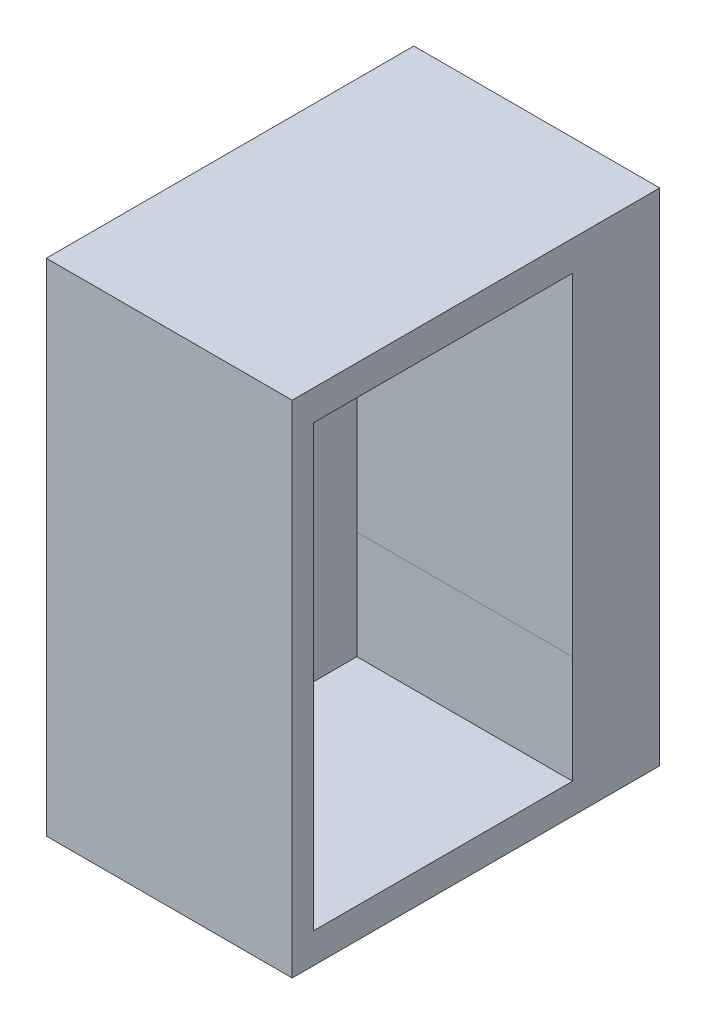
ISO-10303-21;
HEADER;
FILE_DESCRIPTION(('STEP AP214'),'2;1');
FILE_NAME('part.step','',(''),(''),'','','');
FILE_SCHEMA(('AUTOMOTIVE_DESIGN { 1 0 10303 214 1 1 1 1 }'));
ENDSEC;
DATA;
#1=APPLICATION_CONTEXT('core data for automotive mechanical design processes');
#2=APPLICATION_PROTOCOL_DEFINITION('international standard','automotive_design',2000,#1);
#3=PRODUCT_CONTEXT('',#1,'mechanical');
#4=PRODUCT('Part','Part','',(#3));
#5=PRODUCT_RELATED_PRODUCT_CATEGORY('part','',(#4));
#6=PRODUCT_DEFINITION_FORMATION('','',#4);
#7=PRODUCT_DEFINITION_CONTEXT('part definition',#1,'design');
#8=PRODUCT_DEFINITION('design','',#6,#7);
#9=PRODUCT_DEFINITION_SHAPE('','',#8);
#10=(LENGTH_UNIT() NAMED_UNIT(*) SI_UNIT(.MILLI.,.METRE.));
#11=(NAMED_UNIT(*) PLANE_ANGLE_UNIT() SI_UNIT($,.RADIAN.));
#12=(NAMED_UNIT(*) SI_UNIT($,.STERADIAN.) SOLID_ANGLE_UNIT());
#13=UNCERTAINTY_MEASURE_WITH_UNIT(LENGTH_MEASURE(1.E-05),#10,'distance_accuracy_value','');
#14=(GEOMETRIC_REPRESENTATION_CONTEXT(3) GLOBAL_UNCERTAINTY_ASSIGNED_CONTEXT((#13)) GLOBAL_UNIT_ASSIGNED_CONTEXT((#10,
#11,#12)) REPRESENTATION_CONTEXT('',''));
#15=CARTESIAN_POINT('',(0.,0.,0.));
#16=DIRECTION('',(0.,0.,1.));
#17=DIRECTION('',(1.,0.,0.));
#18=AXIS2_PLACEMENT_3D('',#15,#16,#17);
#19=CARTESIAN_POINT('',(-38.,-69.,20.2));
#20=DIRECTION('',(1.,0.,0.));
#21=DIRECTION('',(0.,0.,-1.));
#22=AXIS2_PLACEMENT_3D('',#19,#20,#21);
#23=PLANE('',#22);
#24=DIRECTION('',(0.,-1.,0.));
#25=VECTOR('',#24,1.);
#26=CARTESIAN_POINT('',(-38.,0.,0.));
#27=LINE('',#26,#25);
#28=CARTESIAN_POINT('',(-38.,40.,0.));
#29=VERTEX_POINT('',#28);
#30=CARTESIAN_POINT('',(-38.,-76.,0.));
#31=VERTEX_POINT('',#30);
#32=EDGE_CURVE('E155',#29,#31,#27,.T.);
#33=ORIENTED_EDGE('',*,*,#32,.F.);
#34=DIRECTION('',(0.,0.,-1.));
#35=VECTOR('',#34,1.);
#36=CARTESIAN_POINT('',(-38.,40.,80.2));
#37=LINE('',#36,#35);
#38=CARTESIAN_POINT('',(-38.,40.,85.2));
#39=VERTEX_POINT('',#38);
#40=EDGE_CURVE('E51',#39,#29,#37,.T.);
#41=ORIENTED_EDGE('',*,*,#40,.F.);
#42=DIRECTION('',(0.,1.,0.));
#43=VECTOR('',#42,1.);
#44=CARTESIAN_POINT('',(-38.,-76.,85.2));
#45=LINE('',#44,#43);
#46=CARTESIAN_POINT('',(-38.,-76.,85.2));
#47=VERTEX_POINT('',#46);
#48=EDGE_CURVE('E43',#47,#39,#45,.T.);
#49=ORIENTED_EDGE('',*,*,#48,.F.);
#50=DIRECTION('',(0.,0.,-1.));
#51=VECTOR('',#50,1.);
#52=CARTESIAN_POINT('',(-38.,-76.,26.0999));
#53=LINE('',#52,#51);
#54=CARTESIAN_POINT('',(-38.,-76.,20.2));
#55=VERTEX_POINT('',#54);
#56=EDGE_CURVE('E231',#47,#55,#53,.T.);
#57=ORIENTED_EDGE('',*,*,#56,.T.);
#58=DIRECTION('',(0.,1.,0.));
#59=VECTOR('',#58,1.);
#60=CARTESIAN_POINT('',(-38.,0.,20.2));
#61=LINE('',#60,#59);
#62=CARTESIAN_POINT('',(-38.,-69.,20.2));
#63=VERTEX_POINT('',#62);
#64=EDGE_CURVE('E203',#55,#63,#61,.T.);
#65=ORIENTED_EDGE('',*,*,#64,.T.);
#66=DIRECTION('',(0.,0.,-1.));
#67=VECTOR('',#66,1.);
#68=CARTESIAN_POINT('',(-38.,-69.,80.2));
#69=LINE('',#68,#67);
#70=CARTESIAN_POINT('',(-38.,-69.,80.2));
#71=VERTEX_POINT('',#70);
#72=EDGE_CURVE('E185',#71,#63,#69,.T.);
#73=ORIENTED_EDGE('',*,*,#72,.F.);
#74=DIRECTION('',(0.,1.,0.));
#75=VECTOR('',#74,1.);
#76=CARTESIAN_POINT('',(-38.,-76.,80.2));
#77=LINE('',#76,#75);
#78=CARTESIAN_POINT('',(-38.,33.,80.2));
#79=VERTEX_POINT('',#78);
#80=EDGE_CURVE('E11',#71,#79,#77,.T.);
#81=ORIENTED_EDGE('',*,*,#80,.T.);
#82=DIRECTION('',(0.,0.,-1.));
#83=VECTOR('',#82,1.);
#84=CARTESIAN_POINT('',(-38.,33.,80.2));
#85=LINE('',#84,#83);
#86=CARTESIAN_POINT('',(-38.,33.,20.2));
#87=VERTEX_POINT('',#86);
#88=EDGE_CURVE('E133',#79,#87,#85,.T.);
#89=ORIENTED_EDGE('',*,*,#88,.T.);
#90=DIRECTION('',(0.,-1.,0.));
#91=VECTOR('',#90,1.);
#92=CARTESIAN_POINT('',(-38.,30.,20.2));
#93=LINE('',#92,#91);
#94=CARTESIAN_POINT('',(-38.,-44.,20.2));
#95=VERTEX_POINT('',#94);
#96=EDGE_CURVE('E144',#87,#95,#93,.T.);
#97=ORIENTED_EDGE('',*,*,#96,.T.);
#98=DIRECTION('',(0.,0.,1.));
#99=VECTOR('',#98,1.);
#100=CARTESIAN_POINT('',(-38.,-44.,0.));
#101=LINE('',#100,#99);
#102=CARTESIAN_POINT('',(-38.,-44.,20.1999));
#103=VERTEX_POINT('',#102);
#104=EDGE_CURVE('E243',#103,#95,#101,.T.);
#105=ORIENTED_EDGE('',*,*,#104,.F.);
#106=DIRECTION('',(0.,-1.,0.));
#107=VECTOR('',#106,1.);
#108=CARTESIAN_POINT('',(-38.,0.,20.1999));
#109=LINE('',#108,#107);
#110=CARTESIAN_POINT('',(-38.,-76.,20.1999));
#111=VERTEX_POINT('',#110);
#112=EDGE_CURVE('E151',#103,#111,#109,.T.);
#113=ORIENTED_EDGE('',*,*,#112,.T.);
#114=DIRECTION('',(0.,0.,-1.));
#115=VECTOR('',#114,1.);
#116=CARTESIAN_POINT('',(-38.,-76.,0.));
#117=LINE('',#116,#115);
#118=EDGE_CURVE('E152',#111,#31,#117,.T.);
#119=ORIENTED_EDGE('',*,*,#118,.T.);
#120=EDGE_LOOP('',(#33,#41,#49,#57,#65,#73,#81,#89,#97,#105,#113,#119));
#121=FACE_BOUND('',#120,.T.);
#122=ADVANCED_FACE('F34',(#121),#23,.T.);
#123=CARTESIAN_POINT('',(105.,-76.,0.));
#124=DIRECTION('',(0.,1.,0.));
#125=DIRECTION('',(-1.,0.,0.));
#126=AXIS2_PLACEMENT_3D('',#123,#124,#125);
#127=PLANE('',#126);
#128=ORIENTED_EDGE('',*,*,#118,.F.);
#129=DIRECTION('',(-1.,0.,0.));
#130=VECTOR('',#129,1.);
#131=CARTESIAN_POINT('',(105.,-76.,20.1999));
#132=LINE('',#131,#130);
#133=CARTESIAN_POINT('',(-95.,-76.,20.1999));
#134=VERTEX_POINT('',#133);
#135=EDGE_CURVE('E168',#111,#134,#132,.T.);
#136=ORIENTED_EDGE('',*,*,#135,.T.);
#137=DIRECTION('',(0.,0.,1.));
#138=VECTOR('',#137,1.);
#139=CARTESIAN_POINT('',(-95.,-76.,10.));
#140=LINE('',#139,#138);
#141=CARTESIAN_POINT('',(-95.,-76.,0.));
#142=VERTEX_POINT('',#141);
#143=EDGE_CURVE('E233',#142,#134,#140,.T.);
#144=ORIENTED_EDGE('',*,*,#143,.F.);
#145=DIRECTION('',(-1.,0.,0.));
#146=VECTOR('',#145,1.);
#147=CARTESIAN_POINT('',(105.,-76.,0.));
#148=LINE('',#147,#146);
#149=EDGE_CURVE('E38',#31,#142,#148,.T.);
#150=ORIENTED_EDGE('',*,*,#149,.F.);
#151=EDGE_LOOP('',(#128,#136,#144,#150));
#152=FACE_BOUND('',#151,.T.);
#153=ADVANCED_FACE('F242',(#152),#127,.F.);
#154=CARTESIAN_POINT('',(0.,0.,80.2));
#155=DIRECTION('',(0.,0.,1.));
#156=DIRECTION('',(1.,0.,0.));
#157=AXIS2_PLACEMENT_3D('',#154,#155,#156);
#158=PLANE('',#157);
#159=ORIENTED_EDGE('',*,*,#80,.F.);
#160=DIRECTION('',(-1.,0.,0.));
#161=VECTOR('',#160,1.);
#162=CARTESIAN_POINT('',(0.,-69.,80.2));
#163=LINE('',#162,#161);
#164=CARTESIAN_POINT('',(-88.,-69.,80.2));
#165=VERTEX_POINT('',#164);
#166=EDGE_CURVE('E214',#71,#165,#163,.T.);
#167=ORIENTED_EDGE('',*,*,#166,.T.);
#168=DIRECTION('',(0.,-1.,0.));
#169=VECTOR('',#168,1.);
#170=CARTESIAN_POINT('',(-88.,33.,80.2));
#171=LINE('',#170,#169);
#172=CARTESIAN_POINT('',(-88.,33.,80.2));
#173=VERTEX_POINT('',#172);
#174=EDGE_CURVE('E194',#173,#165,#171,.T.);
#175=ORIENTED_EDGE('',*,*,#174,.F.);
#176=DIRECTION('',(-1.,0.,0.));
#177=VECTOR('',#176,1.);
#178=CARTESIAN_POINT('',(-38.,33.,80.2));
#179=LINE('',#178,#177);
#180=EDGE_CURVE('E147',#79,#173,#179,.T.);
#181=ORIENTED_EDGE('',*,*,#180,.F.);
#182=EDGE_LOOP('',(#159,#167,#175,#181));
#183=FACE_BOUND('',#182,.T.);
#184=ADVANCED_FACE('F277',(#183),#158,.F.);
#185=CARTESIAN_POINT('',(0.,30.,20.2));
#186=DIRECTION('',(0.,0.,-1.));
#187=DIRECTION('',(-1.,0.,0.));
#188=AXIS2_PLACEMENT_3D('',#185,#186,#187);
#189=PLANE('',#188);
#190=ORIENTED_EDGE('',*,*,#96,.F.);
#191=DIRECTION('',(-1.,0.,0.));
#192=VECTOR('',#191,1.);
#193=CARTESIAN_POINT('',(-38.,33.,20.2));
#194=LINE('',#193,#192);
#195=CARTESIAN_POINT('',(-88.,33.,20.2));
#196=VERTEX_POINT('',#195);
#197=EDGE_CURVE('E129',#87,#196,#194,.T.);
#198=ORIENTED_EDGE('',*,*,#197,.T.);
#199=DIRECTION('',(0.,-1.,0.));
#200=VECTOR('',#199,1.);
#201=CARTESIAN_POINT('',(-88.,33.,20.2));
#202=LINE('',#201,#200);
#203=CARTESIAN_POINT('',(-88.,-44.,20.2));
#204=VERTEX_POINT('',#203);
#205=EDGE_CURVE('E189',#196,#204,#202,.T.);
#206=ORIENTED_EDGE('',*,*,#205,.T.);
#207=DIRECTION('',(-1.,0.,0.));
#208=VECTOR('',#207,1.);
#209=CARTESIAN_POINT('',(-95.,-44.,20.2));
#210=LINE('',#209,#208);
#211=EDGE_CURVE('E150',#95,#204,#210,.T.);
#212=ORIENTED_EDGE('',*,*,#211,.F.);
#213=EDGE_LOOP('',(#190,#198,#206,#212));
#214=FACE_BOUND('',#213,.T.);
#215=ADVANCED_FACE('F149',(#214),#189,.F.);
#216=CARTESIAN_POINT('',(0.,-69.,80.2));
#217=DIRECTION('',(0.,-1.,0.));
#218=DIRECTION('',(0.,0.,-1.));
#219=AXIS2_PLACEMENT_3D('',#216,#217,#218);
#220=PLANE('',#219);
#221=DIRECTION('',(-1.,0.,0.));
#222=VECTOR('',#221,1.);
#223=CARTESIAN_POINT('',(0.,-69.,20.2));
#224=LINE('',#223,#222);
#225=CARTESIAN_POINT('',(-88.,-69.,20.2));
#226=VERTEX_POINT('',#225);
#227=EDGE_CURVE('E218',#63,#226,#224,.T.);
#228=ORIENTED_EDGE('',*,*,#227,.T.);
#229=DIRECTION('',(0.,0.,-1.));
#230=VECTOR('',#229,1.);
#231=CARTESIAN_POINT('',(-88.,-69.,80.2));
#232=LINE('',#231,#230);
#233=EDGE_CURVE('E211',#165,#226,#232,.T.);
#234=ORIENTED_EDGE('',*,*,#233,.F.);
#235=ORIENTED_EDGE('',*,*,#166,.F.);
#236=ORIENTED_EDGE('',*,*,#72,.T.);
#237=EDGE_LOOP('',(#228,#234,#235,#236));
#238=FACE_BOUND('',#237,.T.);
#239=ADVANCED_FACE('F275',(#238),#220,.F.);
#240=CARTESIAN_POINT('',(-88.,33.,80.2));
#241=DIRECTION('',(1.,0.,0.));
#242=DIRECTION('',(0.,1.,0.));
#243=AXIS2_PLACEMENT_3D('',#240,#241,#242);
#244=PLANE('',#243);
#245=ORIENTED_EDGE('',*,*,#174,.T.);
#246=ORIENTED_EDGE('',*,*,#233,.T.);
#247=EDGE_CURVE('E186',#204,#226,#202,.T.);
#248=ORIENTED_EDGE('',*,*,#247,.F.);
#249=ORIENTED_EDGE('',*,*,#205,.F.);
#250=DIRECTION('',(0.,0.,-1.));
#251=VECTOR('',#250,1.);
#252=CARTESIAN_POINT('',(-88.,33.,80.2));
#253=LINE('',#252,#251);
#254=EDGE_CURVE('E135',#173,#196,#253,.T.);
#255=ORIENTED_EDGE('',*,*,#254,.F.);
#256=EDGE_LOOP('',(#245,#246,#248,#249,#255));
#257=FACE_BOUND('',#256,.T.);
#258=ADVANCED_FACE('F279',(#257),#244,.T.);
#259=CARTESIAN_POINT('',(0.,0.,85.2));
#260=DIRECTION('',(0.,0.,1.));
#261=DIRECTION('',(1.,0.,0.));
#262=AXIS2_PLACEMENT_3D('',#259,#260,#261);
#263=PLANE('',#262);
#264=ORIENTED_EDGE('',*,*,#48,.T.);
#265=DIRECTION('',(-1.,0.,0.));
#266=VECTOR('',#265,1.);
#267=CARTESIAN_POINT('',(-38.,40.,85.2));
#268=LINE('',#267,#266);
#269=CARTESIAN_POINT('',(-95.,40.,85.2));
#270=VERTEX_POINT('',#269);
#271=EDGE_CURVE('E252',#39,#270,#268,.T.);
#272=ORIENTED_EDGE('',*,*,#271,.T.);
#273=DIRECTION('',(0.,-1.,0.));
#274=VECTOR('',#273,1.);
#275=CARTESIAN_POINT('',(-95.,-76.,85.2));
#276=LINE('',#275,#274);
#277=CARTESIAN_POINT('',(-95.,-76.,85.2));
#278=VERTEX_POINT('',#277);
#279=EDGE_CURVE('E254',#270,#278,#276,.T.);
#280=ORIENTED_EDGE('',*,*,#279,.T.);
#281=DIRECTION('',(1.,0.,0.));
#282=VECTOR('',#281,1.);
#283=CARTESIAN_POINT('',(-38.,-76.,85.2));
#284=LINE('',#283,#282);
#285=EDGE_CURVE('E188',#278,#47,#284,.T.);
#286=ORIENTED_EDGE('',*,*,#285,.T.);
#287=EDGE_LOOP('',(#264,#272,#280,#286));
#288=FACE_BOUND('',#287,.T.);
#289=ADVANCED_FACE('F261',(#288),#263,.T.);
#290=CARTESIAN_POINT('',(0.,0.,20.2));
#291=DIRECTION('',(0.,0.,1.));
#292=DIRECTION('',(1.,0.,0.));
#293=AXIS2_PLACEMENT_3D('',#290,#291,#292);
#294=PLANE('',#293);
#295=DIRECTION('',(-1.,0.,0.));
#296=VECTOR('',#295,1.);
#297=CARTESIAN_POINT('',(0.,-44.,20.2));
#298=LINE('',#297,#296);
#299=CARTESIAN_POINT('',(-95.0000000000002,-44.,20.2));
#300=VERTEX_POINT('',#299);
#301=EDGE_CURVE('E173',#204,#300,#298,.T.);
#302=ORIENTED_EDGE('',*,*,#301,.F.);
#303=ORIENTED_EDGE('',*,*,#247,.T.);
#304=ORIENTED_EDGE('',*,*,#227,.F.);
#305=ORIENTED_EDGE('',*,*,#64,.F.);
#306=DIRECTION('',(-1.,0.,0.));
#307=VECTOR('',#306,1.);
#308=CARTESIAN_POINT('',(0.,-76.,20.2));
#309=LINE('',#308,#307);
#310=CARTESIAN_POINT('',(-95.,-76.,20.2));
#311=VERTEX_POINT('',#310);
#312=EDGE_CURVE('E215',#55,#311,#309,.T.);
#313=ORIENTED_EDGE('',*,*,#312,.T.);
#314=DIRECTION('',(0.,-1.,0.));
#315=VECTOR('',#314,1.);
#316=CARTESIAN_POINT('',(-95.,40.,20.2));
#317=LINE('',#316,#315);
#318=EDGE_CURVE('E141',#300,#311,#317,.T.);
#319=ORIENTED_EDGE('',*,*,#318,.F.);
#320=EDGE_LOOP('',(#302,#303,#304,#305,#313,#319));
#321=FACE_BOUND('',#320,.T.);
#322=ADVANCED_FACE('F269',(#321),#294,.F.);
#323=CARTESIAN_POINT('',(0.,-44.,0.));
#324=DIRECTION('',(0.,-1.,0.));
#325=DIRECTION('',(0.,0.,-1.));
#326=AXIS2_PLACEMENT_3D('',#323,#324,#325);
#327=PLANE('',#326);
#328=DIRECTION('',(-1.,0.,0.));
#329=VECTOR('',#328,1.);
#330=CARTESIAN_POINT('',(0.,-44.,20.1999));
#331=LINE('',#330,#329);
#332=CARTESIAN_POINT('',(-95.,-44.,20.1999));
#333=VERTEX_POINT('',#332);
#334=EDGE_CURVE('E166',#103,#333,#331,.T.);
#335=ORIENTED_EDGE('',*,*,#334,.F.);
#336=ORIENTED_EDGE('',*,*,#104,.T.);
#337=ORIENTED_EDGE('',*,*,#211,.T.);
#338=ORIENTED_EDGE('',*,*,#301,.T.);
#339=DIRECTION('',(0.,0.,-1.));
#340=VECTOR('',#339,1.);
#341=CARTESIAN_POINT('',(-95.,-44.,20.2));
#342=LINE('',#341,#340);
#343=EDGE_CURVE('E165',#300,#333,#342,.T.);
#344=ORIENTED_EDGE('',*,*,#343,.T.);
#345=EDGE_LOOP('',(#335,#336,#337,#338,#344));
#346=FACE_BOUND('',#345,.T.);
#347=ADVANCED_FACE('F280',(#346),#327,.T.);
#348=CARTESIAN_POINT('',(0.,0.,20.1999));
#349=DIRECTION('',(0.,0.,-1.));
#350=DIRECTION('',(-1.,0.,0.));
#351=AXIS2_PLACEMENT_3D('',#348,#349,#350);
#352=PLANE('',#351);
#353=ORIENTED_EDGE('',*,*,#112,.F.);
#354=ORIENTED_EDGE('',*,*,#334,.T.);
#355=DIRECTION('',(0.,1.,0.));
#356=VECTOR('',#355,1.);
#357=CARTESIAN_POINT('',(-95.,0.,20.1999));
#358=LINE('',#357,#356);
#359=EDGE_CURVE('E167',#134,#333,#358,.T.);
#360=ORIENTED_EDGE('',*,*,#359,.F.);
#361=ORIENTED_EDGE('',*,*,#135,.F.);
#362=EDGE_LOOP('',(#353,#354,#360,#361));
#363=FACE_BOUND('',#362,.T.);
#364=ADVANCED_FACE('F36',(#363),#352,.F.);
#365=CARTESIAN_POINT('',(-95.,-40.,10.));
#366=DIRECTION('',(1.,0.,0.));
#367=DIRECTION('',(0.,0.,-1.));
#368=AXIS2_PLACEMENT_3D('',#365,#366,#367);
#369=PLANE('',#368);
#370=DIRECTION('',(0.,-1.,0.));
#371=VECTOR('',#370,1.);
#372=CARTESIAN_POINT('',(-95.,-40.,0.));
#373=LINE('',#372,#371);
#374=CARTESIAN_POINT('',(-95.,40.,0.));
#375=VERTEX_POINT('',#374);
#376=EDGE_CURVE('E163',#375,#142,#373,.T.);
#377=ORIENTED_EDGE('',*,*,#376,.T.);
#378=ORIENTED_EDGE('',*,*,#143,.T.);
#379=ORIENTED_EDGE('',*,*,#359,.T.);
#380=ORIENTED_EDGE('',*,*,#343,.F.);
#381=ORIENTED_EDGE('',*,*,#318,.T.);
#382=DIRECTION('',(0.,0.,-1.));
#383=VECTOR('',#382,1.);
#384=CARTESIAN_POINT('',(-95.,-76.,80.2));
#385=LINE('',#384,#383);
#386=EDGE_CURVE('E140',#278,#311,#385,.T.);
#387=ORIENTED_EDGE('',*,*,#386,.F.);
#388=ORIENTED_EDGE('',*,*,#279,.F.);
#389=DIRECTION('',(0.,0.,-1.));
#390=VECTOR('',#389,1.);
#391=CARTESIAN_POINT('',(-95.,40.,10.));
#392=LINE('',#391,#390);
#393=EDGE_CURVE('E58',#270,#375,#392,.T.);
#394=ORIENTED_EDGE('',*,*,#393,.T.);
#395=EDGE_LOOP('',(#377,#378,#379,#380,#381,#387,#388,#394));
#396=FACE_BOUND('',#395,.T.);
#397=ADVANCED_FACE('F236',(#396),#369,.F.);
#398=CARTESIAN_POINT('',(-95.,40.,10.));
#399=DIRECTION('',(0.,-1.,0.));
#400=DIRECTION('',(0.,0.,-1.));
#401=AXIS2_PLACEMENT_3D('',#398,#399,#400);
#402=PLANE('',#401);
#403=ORIENTED_EDGE('',*,*,#40,.T.);
#404=DIRECTION('',(-1.,0.,0.));
#405=VECTOR('',#404,1.);
#406=CARTESIAN_POINT('',(-95.,40.,0.));
#407=LINE('',#406,#405);
#408=EDGE_CURVE('E161',#29,#375,#407,.T.);
#409=ORIENTED_EDGE('',*,*,#408,.T.);
#410=ORIENTED_EDGE('',*,*,#393,.F.);
#411=ORIENTED_EDGE('',*,*,#271,.F.);
#412=EDGE_LOOP('',(#403,#409,#410,#411));
#413=FACE_BOUND('',#412,.T.);
#414=ADVANCED_FACE('F281',(#413),#402,.F.);
#415=CARTESIAN_POINT('',(0.,0.,0.));
#416=DIRECTION('',(0.,0.,-1.));
#417=DIRECTION('',(-1.,0.,0.));
#418=AXIS2_PLACEMENT_3D('',#415,#416,#417);
#419=PLANE('',#418);
#420=ORIENTED_EDGE('',*,*,#408,.F.);
#421=ORIENTED_EDGE('',*,*,#32,.T.);
#422=ORIENTED_EDGE('',*,*,#149,.T.);
#423=ORIENTED_EDGE('',*,*,#376,.F.);
#424=EDGE_LOOP('',(#420,#421,#422,#423));
#425=FACE_BOUND('',#424,.T.);
#426=ADVANCED_FACE('F240',(#425),#419,.T.);
#427=CARTESIAN_POINT('',(-38.,33.,80.2));
#428=DIRECTION('',(0.,-1.,0.));
#429=DIRECTION('',(1.,0.,0.));
#430=AXIS2_PLACEMENT_3D('',#427,#428,#429);
#431=PLANE('',#430);
#432=ORIENTED_EDGE('',*,*,#180,.T.);
#433=ORIENTED_EDGE('',*,*,#254,.T.);
#434=ORIENTED_EDGE('',*,*,#197,.F.);
#435=ORIENTED_EDGE('',*,*,#88,.F.);
#436=EDGE_LOOP('',(#432,#433,#434,#435));
#437=FACE_BOUND('',#436,.T.);
#438=ADVANCED_FACE('F132',(#437),#431,.T.);
#439=CARTESIAN_POINT('',(0.,-76.,80.2));
#440=DIRECTION('',(0.,-1.,0.));
#441=DIRECTION('',(1.,0.,0.));
#442=AXIS2_PLACEMENT_3D('',#439,#440,#441);
#443=PLANE('',#442);
#444=ORIENTED_EDGE('',*,*,#386,.T.);
#445=ORIENTED_EDGE('',*,*,#312,.F.);
#446=ORIENTED_EDGE('',*,*,#56,.F.);
#447=ORIENTED_EDGE('',*,*,#285,.F.);
#448=EDGE_LOOP('',(#444,#445,#446,#447));
#449=FACE_BOUND('',#448,.T.);
#450=ADVANCED_FACE('F265',(#449),#443,.T.);
#451=CLOSED_SHELL('',(#122,#153,#184,#215,#239,#258,#289,#322,#347,#364,#397,#414,#426,#438,#450));
#452=MANIFOLD_SOLID_BREP('B2',#451);
#453=ADVANCED_BREP_SHAPE_REPRESENTATION('',(#18,#452),#14);
#454=SHAPE_DEFINITION_REPRESENTATION(#9,#453);
ENDSEC;
END-ISO-10303-21;
